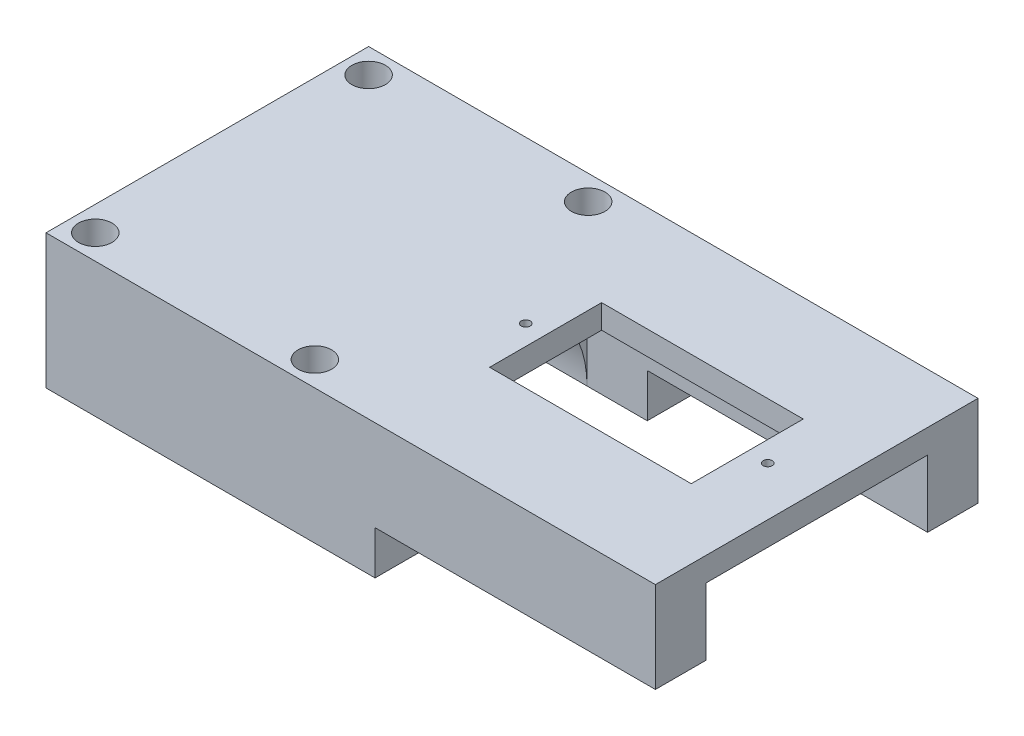
ISO-10303-21;
HEADER;
FILE_DESCRIPTION(('STEP AP214'),'2;1');
FILE_NAME('part.step','',(''),(''),'','','');
FILE_SCHEMA(('AUTOMOTIVE_DESIGN { 1 0 10303 214 1 1 1 1 }'));
ENDSEC;
DATA;
#1=APPLICATION_CONTEXT('core data for automotive mechanical design processes');
#2=APPLICATION_PROTOCOL_DEFINITION('international standard','automotive_design',2000,#1);
#3=PRODUCT_CONTEXT('',#1,'mechanical');
#4=PRODUCT('Part','Part','',(#3));
#5=PRODUCT_RELATED_PRODUCT_CATEGORY('part','',(#4));
#6=PRODUCT_DEFINITION_FORMATION('','',#4);
#7=PRODUCT_DEFINITION_CONTEXT('part definition',#1,'design');
#8=PRODUCT_DEFINITION('design','',#6,#7);
#9=PRODUCT_DEFINITION_SHAPE('','',#8);
#10=(LENGTH_UNIT() NAMED_UNIT(*) SI_UNIT(.MILLI.,.METRE.));
#11=(NAMED_UNIT(*) PLANE_ANGLE_UNIT() SI_UNIT($,.RADIAN.));
#12=(NAMED_UNIT(*) SI_UNIT($,.STERADIAN.) SOLID_ANGLE_UNIT());
#13=UNCERTAINTY_MEASURE_WITH_UNIT(LENGTH_MEASURE(1.E-05),#10,'distance_accuracy_value','');
#14=(GEOMETRIC_REPRESENTATION_CONTEXT(3) GLOBAL_UNCERTAINTY_ASSIGNED_CONTEXT((#13)) GLOBAL_UNIT_ASSIGNED_CONTEXT((#10,
#11,#12)) REPRESENTATION_CONTEXT('',''));
#15=CARTESIAN_POINT('',(0.,0.,0.));
#16=DIRECTION('',(0.,0.,1.));
#17=DIRECTION('',(1.,0.,0.));
#18=AXIS2_PLACEMENT_3D('',#15,#16,#17);
#19=CARTESIAN_POINT('',(15.,30.,18.));
#20=DIRECTION('',(-1.,0.,0.));
#21=DIRECTION('',(0.,0.,1.));
#22=AXIS2_PLACEMENT_3D('',#19,#20,#21);
#23=PLANE('',#22);
#24=DIRECTION('',(0.,-1.,0.));
#25=VECTOR('',#24,1.);
#26=CARTESIAN_POINT('',(15.,27.3313976045781,-12.375));
#27=LINE('',#26,#25);
#28=CARTESIAN_POINT('',(15.,27.3313976045781,-12.375));
#29=VERTEX_POINT('',#28);
#30=CARTESIAN_POINT('',(15.,15.,-12.375));
#31=VERTEX_POINT('',#30);
#32=EDGE_CURVE('E341',#29,#31,#27,.T.);
#33=ORIENTED_EDGE('',*,*,#32,.F.);
#34=DIRECTION('',(0.,0.,-1.));
#35=VECTOR('',#34,1.);
#36=CARTESIAN_POINT('',(15.,27.3313976045781,12.375));
#37=LINE('',#36,#35);
#38=CARTESIAN_POINT('',(15.,27.3313976045781,-1.03791045750838));
#39=VERTEX_POINT('',#38);
#40=EDGE_CURVE('E271',#39,#29,#37,.T.);
#41=ORIENTED_EDGE('',*,*,#40,.F.);
#42=CARTESIAN_POINT('',(15.,15.,0.));
#43=DIRECTION('',(1.,0.,0.));
#44=DIRECTION('',(0.,0.,-1.));
#45=AXIS2_PLACEMENT_3D('',#42,#43,#44);
#46=CIRCLE('',#45,12.375);
#47=EDGE_CURVE('E249',#31,#39,#46,.T.);
#48=ORIENTED_EDGE('',*,*,#47,.F.);
#49=EDGE_LOOP('',(#33,#41,#48));
#50=FACE_BOUND('',#49,.T.);
#51=ADVANCED_FACE('F49',(#50),#23,.F.);
#52=CARTESIAN_POINT('',(15.,27.3313976045781,12.375));
#53=VERTEX_POINT('',#52);
#54=CARTESIAN_POINT('',(15.,27.3313976045781,1.03791045750838));
#55=VERTEX_POINT('',#54);
#56=EDGE_CURVE('E337',#53,#55,#37,.T.);
#57=ORIENTED_EDGE('',*,*,#56,.F.);
#58=DIRECTION('',(0.,1.,0.));
#59=VECTOR('',#58,1.);
#60=CARTESIAN_POINT('',(15.,15.,12.375));
#61=LINE('',#60,#59);
#62=CARTESIAN_POINT('',(15.,15.,12.375));
#63=VERTEX_POINT('',#62);
#64=EDGE_CURVE('E299',#63,#53,#61,.T.);
#65=ORIENTED_EDGE('',*,*,#64,.F.);
#66=EDGE_CURVE('E248',#55,#63,#46,.T.);
#67=ORIENTED_EDGE('',*,*,#66,.F.);
#68=EDGE_LOOP('',(#57,#65,#67));
#69=FACE_BOUND('',#68,.T.);
#70=ADVANCED_FACE('F463',(#69),#23,.F.);
#71=CARTESIAN_POINT('',(-15.,30.,-18.));
#72=DIRECTION('',(0.,0.,1.));
#73=DIRECTION('',(1.,0.,0.));
#74=AXIS2_PLACEMENT_3D('',#71,#72,#73);
#75=PLANE('',#74);
#76=DIRECTION('',(0.,1.,0.));
#77=VECTOR('',#76,1.);
#78=CARTESIAN_POINT('',(53.,27.3313976045781,-18.));
#79=LINE('',#78,#77);
#80=CARTESIAN_POINT('',(53.,19.8616723081027,-18.));
#81=VERTEX_POINT('',#80);
#82=CARTESIAN_POINT('',(53.,30.,-18.));
#83=VERTEX_POINT('',#82);
#84=EDGE_CURVE('E319',#81,#83,#79,.T.);
#85=ORIENTED_EDGE('',*,*,#84,.F.);
#86=DIRECTION('',(1.,0.,0.));
#87=VECTOR('',#86,1.);
#88=CARTESIAN_POINT('',(53.,19.8616723081027,-18.));
#89=LINE('',#88,#87);
#90=CARTESIAN_POINT('',(21.7187331461162,19.8616723081027,-18.));
#91=VERTEX_POINT('',#90);
#92=EDGE_CURVE('E64',#91,#81,#89,.T.);
#93=ORIENTED_EDGE('',*,*,#92,.F.);
#94=DIRECTION('',(0.,1.,0.));
#95=VECTOR('',#94,1.);
#96=CARTESIAN_POINT('',(21.7187331461162,15.,-18.));
#97=LINE('',#96,#95);
#98=CARTESIAN_POINT('',(21.7187331461162,15.,-18.));
#99=VERTEX_POINT('',#98);
#100=EDGE_CURVE('E179',#99,#91,#97,.T.);
#101=ORIENTED_EDGE('',*,*,#100,.F.);
#102=DIRECTION('',(1.,0.,0.));
#103=VECTOR('',#102,1.);
#104=CARTESIAN_POINT('',(-15.,15.,-18.));
#105=LINE('',#104,#103);
#106=CARTESIAN_POINT('',(-15.,15.,-18.));
#107=VERTEX_POINT('',#106);
#108=EDGE_CURVE('E192',#107,#99,#105,.T.);
#109=ORIENTED_EDGE('',*,*,#108,.F.);
#110=DIRECTION('',(0.,-1.,0.));
#111=VECTOR('',#110,1.);
#112=CARTESIAN_POINT('',(-15.,30.,-18.));
#113=LINE('',#112,#111);
#114=CARTESIAN_POINT('',(-15.,30.,-18.));
#115=VERTEX_POINT('',#114);
#116=EDGE_CURVE('E268',#115,#107,#113,.T.);
#117=ORIENTED_EDGE('',*,*,#116,.F.);
#118=DIRECTION('',(-1.,0.,0.));
#119=VECTOR('',#118,1.);
#120=CARTESIAN_POINT('',(-15.,30.,-18.));
#121=LINE('',#120,#119);
#122=EDGE_CURVE('E255',#83,#115,#121,.T.);
#123=ORIENTED_EDGE('',*,*,#122,.F.);
#124=EDGE_LOOP('',(#85,#93,#101,#109,#117,#123));
#125=FACE_BOUND('',#124,.T.);
#126=ADVANCED_FACE('F190',(#125),#75,.F.);
#127=CARTESIAN_POINT('',(-15.,30.,18.));
#128=DIRECTION('',(1.,0.,0.));
#129=DIRECTION('',(0.,0.,-1.));
#130=AXIS2_PLACEMENT_3D('',#127,#128,#129);
#131=PLANE('',#130);
#132=ORIENTED_EDGE('',*,*,#116,.T.);
#133=DIRECTION('',(0.,0.,1.));
#134=VECTOR('',#133,1.);
#135=CARTESIAN_POINT('',(-15.,15.,18.));
#136=LINE('',#135,#134);
#137=CARTESIAN_POINT('',(-15.,15.,-12.375));
#138=VERTEX_POINT('',#137);
#139=EDGE_CURVE('E198',#107,#138,#136,.T.);
#140=ORIENTED_EDGE('',*,*,#139,.T.);
#141=CARTESIAN_POINT('',(-15.,15.,0.));
#142=DIRECTION('',(1.,0.,0.));
#143=DIRECTION('',(0.,0.,-1.));
#144=AXIS2_PLACEMENT_3D('',#141,#142,#143);
#145=CIRCLE('',#144,12.375);
#146=CARTESIAN_POINT('',(-15.,15.,12.375));
#147=VERTEX_POINT('',#146);
#148=EDGE_CURVE('E253',#138,#147,#145,.T.);
#149=ORIENTED_EDGE('',*,*,#148,.T.);
#150=CARTESIAN_POINT('',(-15.,15.,18.));
#151=VERTEX_POINT('',#150);
#152=EDGE_CURVE('E356',#147,#151,#136,.T.);
#153=ORIENTED_EDGE('',*,*,#152,.T.);
#154=DIRECTION('',(0.,-1.,0.));
#155=VECTOR('',#154,1.);
#156=CARTESIAN_POINT('',(-15.,30.,18.));
#157=LINE('',#156,#155);
#158=CARTESIAN_POINT('',(-15.,30.,18.));
#159=VERTEX_POINT('',#158);
#160=EDGE_CURVE('E264',#159,#151,#157,.T.);
#161=ORIENTED_EDGE('',*,*,#160,.F.);
#162=DIRECTION('',(0.,0.,1.));
#163=VECTOR('',#162,1.);
#164=CARTESIAN_POINT('',(-15.,30.,18.));
#165=LINE('',#164,#163);
#166=EDGE_CURVE('E258',#115,#159,#165,.T.);
#167=ORIENTED_EDGE('',*,*,#166,.F.);
#168=EDGE_LOOP('',(#132,#140,#149,#153,#161,#167));
#169=FACE_BOUND('',#168,.T.);
#170=ADVANCED_FACE('F367',(#169),#131,.F.);
#171=CARTESIAN_POINT('',(-15.,30.,18.));
#172=DIRECTION('',(0.,0.,-1.));
#173=DIRECTION('',(-1.,0.,0.));
#174=AXIS2_PLACEMENT_3D('',#171,#172,#173);
#175=PLANE('',#174);
#176=DIRECTION('',(0.,1.,0.));
#177=VECTOR('',#176,1.);
#178=CARTESIAN_POINT('',(21.7187331461162,15.,18.));
#179=LINE('',#178,#177);
#180=CARTESIAN_POINT('',(21.7187331461162,15.,18.));
#181=VERTEX_POINT('',#180);
#182=CARTESIAN_POINT('',(21.7187331461162,19.8616723081027,18.));
#183=VERTEX_POINT('',#182);
#184=EDGE_CURVE('E382',#181,#183,#179,.T.);
#185=ORIENTED_EDGE('',*,*,#184,.T.);
#186=DIRECTION('',(1.,0.,0.));
#187=VECTOR('',#186,1.);
#188=CARTESIAN_POINT('',(53.,19.8616723081027,18.));
#189=LINE('',#188,#187);
#190=CARTESIAN_POINT('',(53.,19.8616723081027,18.));
#191=VERTEX_POINT('',#190);
#192=EDGE_CURVE('E185',#183,#191,#189,.T.);
#193=ORIENTED_EDGE('',*,*,#192,.T.);
#194=DIRECTION('',(0.,-1.,0.));
#195=VECTOR('',#194,1.);
#196=CARTESIAN_POINT('',(53.,30.,18.));
#197=LINE('',#196,#195);
#198=CARTESIAN_POINT('',(53.,30.,18.));
#199=VERTEX_POINT('',#198);
#200=EDGE_CURVE('E345',#199,#191,#197,.T.);
#201=ORIENTED_EDGE('',*,*,#200,.F.);
#202=DIRECTION('',(1.,0.,0.));
#203=VECTOR('',#202,1.);
#204=CARTESIAN_POINT('',(-15.,30.,18.));
#205=LINE('',#204,#203);
#206=EDGE_CURVE('E261',#159,#199,#205,.T.);
#207=ORIENTED_EDGE('',*,*,#206,.F.);
#208=ORIENTED_EDGE('',*,*,#160,.T.);
#209=DIRECTION('',(1.,0.,0.));
#210=VECTOR('',#209,1.);
#211=CARTESIAN_POINT('',(-15.,15.,18.));
#212=LINE('',#211,#210);
#213=EDGE_CURVE('E201',#151,#181,#212,.T.);
#214=ORIENTED_EDGE('',*,*,#213,.T.);
#215=EDGE_LOOP('',(#185,#193,#201,#207,#208,#214));
#216=FACE_BOUND('',#215,.T.);
#217=ADVANCED_FACE('F380',(#216),#175,.F.);
#218=CARTESIAN_POINT('',(0.,30.,0.));
#219=DIRECTION('',(0.,-1.,0.));
#220=DIRECTION('',(0.,0.,-1.));
#221=AXIS2_PLACEMENT_3D('',#218,#219,#220);
#222=PLANE('',#221);
#223=CARTESIAN_POINT('',(20.5328469135084,30.,0.));
#224=DIRECTION('',(0.,1.,0.));
#225=DIRECTION('',(0.,0.,1.));
#226=AXIS2_PLACEMENT_3D('',#223,#224,#225);
#227=CIRCLE('',#226,0.499999999999999);
#228=CARTESIAN_POINT('',(20.5328469135084,30.,0.499999999999999));
#229=VERTEX_POINT('',#228);
#230=EDGE_CURVE('E423',#229,#229,#227,.T.);
#231=ORIENTED_EDGE('',*,*,#230,.F.);
#232=EDGE_LOOP('',(#231));
#233=FACE_BOUND('',#232,.T.);
#234=CARTESIAN_POINT('',(47.5328469135084,30.,0.));
#235=DIRECTION('',(0.,1.,0.));
#236=DIRECTION('',(0.,0.,-1.));
#237=AXIS2_PLACEMENT_3D('',#234,#235,#236);
#238=CIRCLE('',#237,0.499999999999999);
#239=CARTESIAN_POINT('',(47.5328469135084,30.,-0.499999999999999));
#240=VERTEX_POINT('',#239);
#241=EDGE_CURVE('E422',#240,#240,#238,.T.);
#242=ORIENTED_EDGE('',*,*,#241,.F.);
#243=EDGE_LOOP('',(#242));
#244=FACE_BOUND('',#243,.T.);
#245=DIRECTION('',(-1.,0.,0.));
#246=VECTOR('',#245,1.);
#247=CARTESIAN_POINT('',(22.75,30.,-6.25));
#248=LINE('',#247,#246);
#249=CARTESIAN_POINT('',(45.25,30.,-6.25));
#250=VERTEX_POINT('',#249);
#251=CARTESIAN_POINT('',(22.75,30.,-6.25));
#252=VERTEX_POINT('',#251);
#253=EDGE_CURVE('E415',#250,#252,#248,.T.);
#254=ORIENTED_EDGE('',*,*,#253,.F.);
#255=DIRECTION('',(0.,0.,-1.));
#256=VECTOR('',#255,1.);
#257=CARTESIAN_POINT('',(45.25,30.,6.25));
#258=LINE('',#257,#256);
#259=CARTESIAN_POINT('',(45.25,30.,6.25));
#260=VERTEX_POINT('',#259);
#261=EDGE_CURVE('E419',#260,#250,#258,.T.);
#262=ORIENTED_EDGE('',*,*,#261,.F.);
#263=DIRECTION('',(1.,0.,0.));
#264=VECTOR('',#263,1.);
#265=CARTESIAN_POINT('',(22.75,30.,6.25));
#266=LINE('',#265,#264);
#267=CARTESIAN_POINT('',(22.75,30.,6.25));
#268=VERTEX_POINT('',#267);
#269=EDGE_CURVE('E400',#268,#260,#266,.T.);
#270=ORIENTED_EDGE('',*,*,#269,.F.);
#271=DIRECTION('',(0.,0.,1.));
#272=VECTOR('',#271,1.);
#273=CARTESIAN_POINT('',(22.75,30.,6.25));
#274=LINE('',#273,#272);
#275=EDGE_CURVE('E411',#252,#268,#274,.T.);
#276=ORIENTED_EDGE('',*,*,#275,.F.);
#277=EDGE_LOOP('',(#254,#262,#270,#276));
#278=FACE_BOUND('',#277,.T.);
#279=CARTESIAN_POINT('',(12.25,30.,-15.25));
#280=DIRECTION('',(0.,1.,0.));
#281=DIRECTION('',(0.,0.,-1.));
#282=AXIS2_PLACEMENT_3D('',#279,#280,#281);
#283=CIRCLE('',#282,1.875);
#284=CARTESIAN_POINT('',(12.25,30.,-17.125));
#285=VERTEX_POINT('',#284);
#286=EDGE_CURVE('E232',#285,#285,#283,.T.);
#287=ORIENTED_EDGE('',*,*,#286,.F.);
#288=EDGE_LOOP('',(#287));
#289=FACE_BOUND('',#288,.T.);
#290=CARTESIAN_POINT('',(12.25,30.,15.25));
#291=DIRECTION('',(0.,1.,0.));
#292=DIRECTION('',(0.,0.,1.));
#293=AXIS2_PLACEMENT_3D('',#290,#291,#292);
#294=CIRCLE('',#293,1.875);
#295=CARTESIAN_POINT('',(12.25,30.,17.125));
#296=VERTEX_POINT('',#295);
#297=EDGE_CURVE('E238',#296,#296,#294,.T.);
#298=ORIENTED_EDGE('',*,*,#297,.F.);
#299=EDGE_LOOP('',(#298));
#300=FACE_BOUND('',#299,.T.);
#301=CARTESIAN_POINT('',(-12.25,30.,15.25));
#302=DIRECTION('',(0.,1.,0.));
#303=DIRECTION('',(0.,0.,-1.));
#304=AXIS2_PLACEMENT_3D('',#301,#302,#303);
#305=CIRCLE('',#304,1.875);
#306=CARTESIAN_POINT('',(-12.25,30.,13.375));
#307=VERTEX_POINT('',#306);
#308=EDGE_CURVE('E233',#307,#307,#305,.T.);
#309=ORIENTED_EDGE('',*,*,#308,.F.);
#310=EDGE_LOOP('',(#309));
#311=FACE_BOUND('',#310,.T.);
#312=CARTESIAN_POINT('',(-12.25,30.,-15.25));
#313=DIRECTION('',(0.,1.,0.));
#314=DIRECTION('',(0.,0.,1.));
#315=AXIS2_PLACEMENT_3D('',#312,#313,#314);
#316=CIRCLE('',#315,1.875);
#317=CARTESIAN_POINT('',(-12.25,30.,-13.375));
#318=VERTEX_POINT('',#317);
#319=EDGE_CURVE('E237',#318,#318,#316,.T.);
#320=ORIENTED_EDGE('',*,*,#319,.F.);
#321=EDGE_LOOP('',(#320));
#322=FACE_BOUND('',#321,.T.);
#323=ORIENTED_EDGE('',*,*,#206,.T.);
#324=DIRECTION('',(0.,0.,1.));
#325=VECTOR('',#324,1.);
#326=CARTESIAN_POINT('',(53.,30.,18.));
#327=LINE('',#326,#325);
#328=EDGE_CURVE('E323',#83,#199,#327,.T.);
#329=ORIENTED_EDGE('',*,*,#328,.F.);
#330=ORIENTED_EDGE('',*,*,#122,.T.);
#331=ORIENTED_EDGE('',*,*,#166,.T.);
#332=EDGE_LOOP('',(#323,#329,#330,#331));
#333=FACE_BOUND('',#332,.T.);
#334=ADVANCED_FACE('F386',(#233,#244,#278,#289,#300,#311,#322,#333),#222,.F.);
#335=CARTESIAN_POINT('',(-25.,15.,0.));
#336=DIRECTION('',(1.,0.,0.));
#337=DIRECTION('',(0.,0.,-1.));
#338=AXIS2_PLACEMENT_3D('',#335,#336,#337);
#339=CYLINDRICAL_SURFACE('',#338,12.375);
#340=ORIENTED_EDGE('',*,*,#47,.T.);
#341=EDGE_CURVE('E254',#39,#55,#46,.T.);
#342=ORIENTED_EDGE('',*,*,#341,.T.);
#343=ORIENTED_EDGE('',*,*,#66,.T.);
#344=DIRECTION('',(1.,0.,0.));
#345=VECTOR('',#344,1.);
#346=CARTESIAN_POINT('',(-25.,15.,12.375));
#347=LINE('',#346,#345);
#348=EDGE_CURVE('E228',#63,#147,#347,.F.);
#349=ORIENTED_EDGE('',*,*,#348,.T.);
#350=ORIENTED_EDGE('',*,*,#148,.F.);
#351=DIRECTION('',(1.,0.,0.));
#352=VECTOR('',#351,1.);
#353=CARTESIAN_POINT('',(-25.,15.,-12.375));
#354=LINE('',#353,#352);
#355=EDGE_CURVE('E224',#138,#31,#354,.T.);
#356=ORIENTED_EDGE('',*,*,#355,.T.);
#357=EDGE_LOOP('',(#340,#342,#343,#349,#350,#356));
#358=FACE_BOUND('',#357,.T.);
#359=ADVANCED_FACE('F370',(#358),#339,.F.);
#360=CARTESIAN_POINT('',(-12.25,-10.,-15.25));
#361=DIRECTION('',(0.,1.,0.));
#362=DIRECTION('',(0.,0.,1.));
#363=AXIS2_PLACEMENT_3D('',#360,#361,#362);
#364=CYLINDRICAL_SURFACE('',#363,1.875);
#365=CARTESIAN_POINT('',(-12.25,15.,-15.25));
#366=DIRECTION('',(0.,1.,0.));
#367=DIRECTION('',(0.,0.,1.));
#368=AXIS2_PLACEMENT_3D('',#365,#366,#367);
#369=CIRCLE('',#368,1.875);
#370=CARTESIAN_POINT('',(-12.25,15.,-13.375));
#371=VERTEX_POINT('',#370);
#372=EDGE_CURVE('E220',#371,#371,#369,.F.);
#373=ORIENTED_EDGE('',*,*,#372,.T.);
#374=EDGE_LOOP('',(#373));
#375=FACE_BOUND('',#374,.T.);
#376=ORIENTED_EDGE('',*,*,#319,.T.);
#377=EDGE_LOOP('',(#376));
#378=FACE_BOUND('',#377,.T.);
#379=ADVANCED_FACE('F497',(#375,#378),#364,.F.);
#380=CARTESIAN_POINT('',(-12.25,-10.,15.25));
#381=DIRECTION('',(0.,1.,0.));
#382=DIRECTION('',(0.,0.,1.));
#383=AXIS2_PLACEMENT_3D('',#380,#381,#382);
#384=CYLINDRICAL_SURFACE('',#383,1.875);
#385=CARTESIAN_POINT('',(-12.25,15.,15.25));
#386=DIRECTION('',(0.,1.,0.));
#387=DIRECTION('',(0.,0.,1.));
#388=AXIS2_PLACEMENT_3D('',#385,#386,#387);
#389=CIRCLE('',#388,1.875);
#390=CARTESIAN_POINT('',(-12.25,15.,17.125));
#391=VERTEX_POINT('',#390);
#392=EDGE_CURVE('E216',#391,#391,#389,.F.);
#393=ORIENTED_EDGE('',*,*,#392,.T.);
#394=EDGE_LOOP('',(#393));
#395=FACE_BOUND('',#394,.T.);
#396=ORIENTED_EDGE('',*,*,#308,.T.);
#397=EDGE_LOOP('',(#396));
#398=FACE_BOUND('',#397,.T.);
#399=ADVANCED_FACE('F500',(#395,#398),#384,.F.);
#400=CARTESIAN_POINT('',(12.25,-10.,15.25));
#401=DIRECTION('',(0.,1.,0.));
#402=DIRECTION('',(0.,0.,1.));
#403=AXIS2_PLACEMENT_3D('',#400,#401,#402);
#404=CYLINDRICAL_SURFACE('',#403,1.875);
#405=CARTESIAN_POINT('',(12.25,15.,15.25));
#406=DIRECTION('',(0.,1.,0.));
#407=DIRECTION('',(0.,0.,1.));
#408=AXIS2_PLACEMENT_3D('',#405,#406,#407);
#409=CIRCLE('',#408,1.875);
#410=CARTESIAN_POINT('',(12.25,15.,17.125));
#411=VERTEX_POINT('',#410);
#412=EDGE_CURVE('E206',#411,#411,#409,.F.);
#413=ORIENTED_EDGE('',*,*,#412,.T.);
#414=EDGE_LOOP('',(#413));
#415=FACE_BOUND('',#414,.T.);
#416=ORIENTED_EDGE('',*,*,#297,.T.);
#417=EDGE_LOOP('',(#416));
#418=FACE_BOUND('',#417,.T.);
#419=ADVANCED_FACE('F505',(#415,#418),#404,.F.);
#420=CARTESIAN_POINT('',(12.25,-10.,-15.25));
#421=DIRECTION('',(0.,1.,0.));
#422=DIRECTION('',(0.,0.,1.));
#423=AXIS2_PLACEMENT_3D('',#420,#421,#422);
#424=CYLINDRICAL_SURFACE('',#423,1.875);
#425=CARTESIAN_POINT('',(12.25,15.,-15.25));
#426=DIRECTION('',(0.,1.,0.));
#427=DIRECTION('',(0.,0.,1.));
#428=AXIS2_PLACEMENT_3D('',#425,#426,#427);
#429=CIRCLE('',#428,1.875);
#430=CARTESIAN_POINT('',(12.25,15.,-13.375));
#431=VERTEX_POINT('',#430);
#432=EDGE_CURVE('E200',#431,#431,#429,.F.);
#433=ORIENTED_EDGE('',*,*,#432,.T.);
#434=EDGE_LOOP('',(#433));
#435=FACE_BOUND('',#434,.T.);
#436=ORIENTED_EDGE('',*,*,#286,.T.);
#437=EDGE_LOOP('',(#436));
#438=FACE_BOUND('',#437,.T.);
#439=ADVANCED_FACE('F502',(#435,#438),#424,.F.);
#440=CARTESIAN_POINT('',(-15.,15.,18.));
#441=DIRECTION('',(0.,1.,0.));
#442=DIRECTION('',(0.,0.,1.));
#443=AXIS2_PLACEMENT_3D('',#440,#441,#442);
#444=PLANE('',#443);
#445=ORIENTED_EDGE('',*,*,#372,.F.);
#446=EDGE_LOOP('',(#445));
#447=FACE_BOUND('',#446,.T.);
#448=ORIENTED_EDGE('',*,*,#432,.F.);
#449=EDGE_LOOP('',(#448));
#450=FACE_BOUND('',#449,.T.);
#451=ORIENTED_EDGE('',*,*,#108,.T.);
#452=DIRECTION('',(0.,0.,-1.));
#453=VECTOR('',#452,1.);
#454=CARTESIAN_POINT('',(21.7187331461162,15.,18.));
#455=LINE('',#454,#453);
#456=CARTESIAN_POINT('',(21.7187331461162,15.,-12.375));
#457=VERTEX_POINT('',#456);
#458=EDGE_CURVE('E175',#457,#99,#455,.T.);
#459=ORIENTED_EDGE('',*,*,#458,.F.);
#460=DIRECTION('',(-1.,0.,0.));
#461=VECTOR('',#460,1.);
#462=CARTESIAN_POINT('',(53.,15.,-12.375));
#463=LINE('',#462,#461);
#464=EDGE_CURVE('E332',#457,#31,#463,.T.);
#465=ORIENTED_EDGE('',*,*,#464,.T.);
#466=ORIENTED_EDGE('',*,*,#355,.F.);
#467=ORIENTED_EDGE('',*,*,#139,.F.);
#468=EDGE_LOOP('',(#451,#459,#465,#466,#467));
#469=FACE_BOUND('',#468,.T.);
#470=ADVANCED_FACE('F196',(#447,#450,#469),#444,.F.);
#471=ORIENTED_EDGE('',*,*,#392,.F.);
#472=EDGE_LOOP('',(#471));
#473=FACE_BOUND('',#472,.T.);
#474=ORIENTED_EDGE('',*,*,#412,.F.);
#475=EDGE_LOOP('',(#474));
#476=FACE_BOUND('',#475,.T.);
#477=DIRECTION('',(-1.,0.,0.));
#478=VECTOR('',#477,1.);
#479=CARTESIAN_POINT('',(53.,15.,12.375));
#480=LINE('',#479,#478);
#481=CARTESIAN_POINT('',(21.7187331461162,15.,12.375));
#482=VERTEX_POINT('',#481);
#483=EDGE_CURVE('E354',#482,#63,#480,.T.);
#484=ORIENTED_EDGE('',*,*,#483,.F.);
#485=EDGE_CURVE('E184',#181,#482,#455,.T.);
#486=ORIENTED_EDGE('',*,*,#485,.F.);
#487=ORIENTED_EDGE('',*,*,#213,.F.);
#488=ORIENTED_EDGE('',*,*,#152,.F.);
#489=ORIENTED_EDGE('',*,*,#348,.F.);
#490=EDGE_LOOP('',(#484,#486,#487,#488,#489));
#491=FACE_BOUND('',#490,.T.);
#492=ADVANCED_FACE('F376',(#473,#476,#491),#444,.F.);
#493=CARTESIAN_POINT('',(53.,15.,12.375));
#494=DIRECTION('',(0.,0.,1.));
#495=DIRECTION('',(1.,0.,0.));
#496=AXIS2_PLACEMENT_3D('',#493,#494,#495);
#497=PLANE('',#496);
#498=DIRECTION('',(0.,1.,0.));
#499=VECTOR('',#498,1.);
#500=CARTESIAN_POINT('',(53.,15.,12.375));
#501=LINE('',#500,#499);
#502=CARTESIAN_POINT('',(53.,19.8616723081027,12.375));
#503=VERTEX_POINT('',#502);
#504=CARTESIAN_POINT('',(53.,27.3313976045781,12.375));
#505=VERTEX_POINT('',#504);
#506=EDGE_CURVE('E325',#503,#505,#501,.T.);
#507=ORIENTED_EDGE('',*,*,#506,.F.);
#508=DIRECTION('',(-1.,0.,0.));
#509=VECTOR('',#508,1.);
#510=CARTESIAN_POINT('',(53.,19.8616723081027,12.375));
#511=LINE('',#510,#509);
#512=CARTESIAN_POINT('',(21.7187331461162,19.8616723081027,12.375));
#513=VERTEX_POINT('',#512);
#514=EDGE_CURVE('E72',#503,#513,#511,.T.);
#515=ORIENTED_EDGE('',*,*,#514,.T.);
#516=DIRECTION('',(0.,-1.,0.));
#517=VECTOR('',#516,1.);
#518=CARTESIAN_POINT('',(21.7187331461162,15.,12.375));
#519=LINE('',#518,#517);
#520=EDGE_CURVE('E427',#513,#482,#519,.T.);
#521=ORIENTED_EDGE('',*,*,#520,.T.);
#522=ORIENTED_EDGE('',*,*,#483,.T.);
#523=ORIENTED_EDGE('',*,*,#64,.T.);
#524=DIRECTION('',(-1.,0.,0.));
#525=VECTOR('',#524,1.);
#526=CARTESIAN_POINT('',(53.,27.3313976045781,12.375));
#527=LINE('',#526,#525);
#528=EDGE_CURVE('E351',#505,#53,#527,.T.);
#529=ORIENTED_EDGE('',*,*,#528,.F.);
#530=EDGE_LOOP('',(#507,#515,#521,#522,#523,#529));
#531=FACE_BOUND('',#530,.T.);
#532=ADVANCED_FACE('F465',(#531),#497,.F.);
#533=CARTESIAN_POINT('',(53.,27.3313976045781,12.375));
#534=DIRECTION('',(0.,1.,0.));
#535=DIRECTION('',(0.,0.,1.));
#536=AXIS2_PLACEMENT_3D('',#533,#534,#535);
#537=PLANE('',#536);
#538=CARTESIAN_POINT('',(20.5328469135084,27.3313976045781,0.));
#539=DIRECTION('',(0.,1.,0.));
#540=DIRECTION('',(0.,0.,1.));
#541=AXIS2_PLACEMENT_3D('',#538,#539,#540);
#542=CIRCLE('',#541,0.499999999999999);
#543=CARTESIAN_POINT('',(20.5328469135084,27.3313976045781,0.499999999999999));
#544=VERTEX_POINT('',#543);
#545=EDGE_CURVE('E295',#544,#544,#542,.T.);
#546=ORIENTED_EDGE('',*,*,#545,.T.);
#547=EDGE_LOOP('',(#546));
#548=FACE_BOUND('',#547,.T.);
#549=CARTESIAN_POINT('',(47.5328469135084,27.3313976045781,0.));
#550=DIRECTION('',(0.,1.,0.));
#551=DIRECTION('',(0.,0.,1.));
#552=AXIS2_PLACEMENT_3D('',#549,#550,#551);
#553=CIRCLE('',#552,0.499999999999999);
#554=CARTESIAN_POINT('',(47.5328469135084,27.3313976045781,0.499999999999999));
#555=VERTEX_POINT('',#554);
#556=EDGE_CURVE('E291',#555,#555,#553,.T.);
#557=ORIENTED_EDGE('',*,*,#556,.T.);
#558=EDGE_LOOP('',(#557));
#559=FACE_BOUND('',#558,.T.);
#560=DIRECTION('',(1.,0.,0.));
#561=VECTOR('',#560,1.);
#562=CARTESIAN_POINT('',(53.,27.3313976045781,6.25));
#563=LINE('',#562,#561);
#564=CARTESIAN_POINT('',(22.75,27.3313976045781,6.25));
#565=VERTEX_POINT('',#564);
#566=CARTESIAN_POINT('',(45.25,27.3313976045781,6.25));
#567=VERTEX_POINT('',#566);
#568=EDGE_CURVE('E283',#565,#567,#563,.T.);
#569=ORIENTED_EDGE('',*,*,#568,.T.);
#570=DIRECTION('',(0.,0.,-1.));
#571=VECTOR('',#570,1.);
#572=CARTESIAN_POINT('',(45.25,27.3313976045781,12.375));
#573=LINE('',#572,#571);
#574=CARTESIAN_POINT('',(45.25,27.3313976045781,-6.25));
#575=VERTEX_POINT('',#574);
#576=EDGE_CURVE('E287',#567,#575,#573,.T.);
#577=ORIENTED_EDGE('',*,*,#576,.T.);
#578=DIRECTION('',(-1.,0.,0.));
#579=VECTOR('',#578,1.);
#580=CARTESIAN_POINT('',(53.,27.3313976045781,-6.25));
#581=LINE('',#580,#579);
#582=CARTESIAN_POINT('',(22.75,27.3313976045781,-6.25));
#583=VERTEX_POINT('',#582);
#584=EDGE_CURVE('E275',#575,#583,#581,.T.);
#585=ORIENTED_EDGE('',*,*,#584,.T.);
#586=DIRECTION('',(0.,0.,1.));
#587=VECTOR('',#586,1.);
#588=CARTESIAN_POINT('',(22.75,27.3313976045781,12.375));
#589=LINE('',#588,#587);
#590=EDGE_CURVE('E279',#583,#565,#589,.T.);
#591=ORIENTED_EDGE('',*,*,#590,.T.);
#592=EDGE_LOOP('',(#569,#577,#585,#591));
#593=FACE_BOUND('',#592,.T.);
#594=ORIENTED_EDGE('',*,*,#56,.T.);
#595=EDGE_CURVE('E336',#55,#39,#37,.T.);
#596=ORIENTED_EDGE('',*,*,#595,.T.);
#597=ORIENTED_EDGE('',*,*,#40,.T.);
#598=DIRECTION('',(-1.,0.,0.));
#599=VECTOR('',#598,1.);
#600=CARTESIAN_POINT('',(53.,27.3313976045781,-12.375));
#601=LINE('',#600,#599);
#602=CARTESIAN_POINT('',(53.,27.3313976045781,-12.375));
#603=VERTEX_POINT('',#602);
#604=EDGE_CURVE('E348',#603,#29,#601,.T.);
#605=ORIENTED_EDGE('',*,*,#604,.F.);
#606=DIRECTION('',(0.,0.,-1.));
#607=VECTOR('',#606,1.);
#608=CARTESIAN_POINT('',(53.,27.3313976045781,12.375));
#609=LINE('',#608,#607);
#610=EDGE_CURVE('E316',#505,#603,#609,.T.);
#611=ORIENTED_EDGE('',*,*,#610,.F.);
#612=ORIENTED_EDGE('',*,*,#528,.T.);
#613=EDGE_LOOP('',(#594,#596,#597,#605,#611,#612));
#614=FACE_BOUND('',#613,.T.);
#615=ADVANCED_FACE('F454',(#548,#559,#593,#614),#537,.F.);
#616=CARTESIAN_POINT('',(53.,27.3313976045781,-12.375));
#617=DIRECTION('',(0.,0.,-1.));
#618=DIRECTION('',(-1.,0.,0.));
#619=AXIS2_PLACEMENT_3D('',#616,#617,#618);
#620=PLANE('',#619);
#621=DIRECTION('',(0.,1.,0.));
#622=VECTOR('',#621,1.);
#623=CARTESIAN_POINT('',(21.7187331461162,27.3313976045781,-12.375));
#624=LINE('',#623,#622);
#625=CARTESIAN_POINT('',(21.7187331461162,19.8616723081027,-12.375));
#626=VERTEX_POINT('',#625);
#627=EDGE_CURVE('E11',#457,#626,#624,.T.);
#628=ORIENTED_EDGE('',*,*,#627,.T.);
#629=DIRECTION('',(1.,0.,0.));
#630=VECTOR('',#629,1.);
#631=CARTESIAN_POINT('',(53.,19.8616723081027,-12.375));
#632=LINE('',#631,#630);
#633=CARTESIAN_POINT('',(53.,19.8616723081027,-12.375));
#634=VERTEX_POINT('',#633);
#635=EDGE_CURVE('E303',#626,#634,#632,.T.);
#636=ORIENTED_EDGE('',*,*,#635,.T.);
#637=DIRECTION('',(0.,-1.,0.));
#638=VECTOR('',#637,1.);
#639=CARTESIAN_POINT('',(53.,27.3313976045781,-12.375));
#640=LINE('',#639,#638);
#641=EDGE_CURVE('E310',#603,#634,#640,.T.);
#642=ORIENTED_EDGE('',*,*,#641,.F.);
#643=ORIENTED_EDGE('',*,*,#604,.T.);
#644=ORIENTED_EDGE('',*,*,#32,.T.);
#645=ORIENTED_EDGE('',*,*,#464,.F.);
#646=EDGE_LOOP('',(#628,#636,#642,#643,#644,#645));
#647=FACE_BOUND('',#646,.T.);
#648=ADVANCED_FACE('F308',(#647),#620,.F.);
#649=CARTESIAN_POINT('',(53.,0.,0.));
#650=DIRECTION('',(1.,0.,0.));
#651=DIRECTION('',(0.,0.,-1.));
#652=AXIS2_PLACEMENT_3D('',#649,#650,#651);
#653=PLANE('',#652);
#654=DIRECTION('',(0.,0.,1.));
#655=VECTOR('',#654,1.);
#656=CARTESIAN_POINT('',(53.,19.8616723081027,0.));
#657=LINE('',#656,#655);
#658=EDGE_CURVE('E57',#81,#634,#657,.T.);
#659=ORIENTED_EDGE('',*,*,#658,.F.);
#660=ORIENTED_EDGE('',*,*,#84,.T.);
#661=ORIENTED_EDGE('',*,*,#328,.T.);
#662=ORIENTED_EDGE('',*,*,#200,.T.);
#663=DIRECTION('',(0.,0.,-1.));
#664=VECTOR('',#663,1.);
#665=CARTESIAN_POINT('',(53.,19.8616723081027,18.));
#666=LINE('',#665,#664);
#667=EDGE_CURVE('E312',#191,#503,#666,.T.);
#668=ORIENTED_EDGE('',*,*,#667,.T.);
#669=ORIENTED_EDGE('',*,*,#506,.T.);
#670=ORIENTED_EDGE('',*,*,#610,.T.);
#671=ORIENTED_EDGE('',*,*,#641,.T.);
#672=EDGE_LOOP('',(#659,#660,#661,#662,#668,#669,#670,#671));
#673=FACE_BOUND('',#672,.T.);
#674=ADVANCED_FACE('F314',(#673),#653,.T.);
#675=CARTESIAN_POINT('',(15.,0.,0.));
#676=DIRECTION('',(1.,0.,0.));
#677=DIRECTION('',(0.,0.,-1.));
#678=AXIS2_PLACEMENT_3D('',#675,#676,#677);
#679=PLANE('',#678);
#680=ORIENTED_EDGE('',*,*,#341,.F.);
#681=ORIENTED_EDGE('',*,*,#595,.F.);
#682=EDGE_LOOP('',(#680,#681));
#683=FACE_BOUND('',#682,.T.);
#684=ADVANCED_FACE('F458',(#683),#679,.F.);
#685=CARTESIAN_POINT('',(45.25,20.,6.25));
#686=DIRECTION('',(1.,0.,0.));
#687=DIRECTION('',(0.,0.,-1.));
#688=AXIS2_PLACEMENT_3D('',#685,#686,#687);
#689=PLANE('',#688);
#690=DIRECTION('',(0.,1.,0.));
#691=VECTOR('',#690,1.);
#692=CARTESIAN_POINT('',(45.25,20.,6.25));
#693=LINE('',#692,#691);
#694=EDGE_CURVE('E296',#567,#260,#693,.T.);
#695=ORIENTED_EDGE('',*,*,#694,.T.);
#696=ORIENTED_EDGE('',*,*,#261,.T.);
#697=DIRECTION('',(0.,1.,0.));
#698=VECTOR('',#697,1.);
#699=CARTESIAN_POINT('',(45.25,20.,-6.25));
#700=LINE('',#699,#698);
#701=EDGE_CURVE('E395',#575,#250,#700,.T.);
#702=ORIENTED_EDGE('',*,*,#701,.F.);
#703=ORIENTED_EDGE('',*,*,#576,.F.);
#704=EDGE_LOOP('',(#695,#696,#702,#703));
#705=FACE_BOUND('',#704,.T.);
#706=ADVANCED_FACE('F525',(#705),#689,.F.);
#707=CARTESIAN_POINT('',(22.75,20.,6.25));
#708=DIRECTION('',(0.,0.,1.));
#709=DIRECTION('',(1.,0.,0.));
#710=AXIS2_PLACEMENT_3D('',#707,#708,#709);
#711=PLANE('',#710);
#712=DIRECTION('',(0.,1.,0.));
#713=VECTOR('',#712,1.);
#714=CARTESIAN_POINT('',(22.75,20.,6.25));
#715=LINE('',#714,#713);
#716=EDGE_CURVE('E403',#565,#268,#715,.T.);
#717=ORIENTED_EDGE('',*,*,#716,.T.);
#718=ORIENTED_EDGE('',*,*,#269,.T.);
#719=ORIENTED_EDGE('',*,*,#694,.F.);
#720=ORIENTED_EDGE('',*,*,#568,.F.);
#721=EDGE_LOOP('',(#717,#718,#719,#720));
#722=FACE_BOUND('',#721,.T.);
#723=ADVANCED_FACE('F530',(#722),#711,.F.);
#724=CARTESIAN_POINT('',(22.75,20.,6.25));
#725=DIRECTION('',(-1.,0.,0.));
#726=DIRECTION('',(0.,0.,1.));
#727=AXIS2_PLACEMENT_3D('',#724,#725,#726);
#728=PLANE('',#727);
#729=DIRECTION('',(0.,1.,0.));
#730=VECTOR('',#729,1.);
#731=CARTESIAN_POINT('',(22.75,20.,-6.25));
#732=LINE('',#731,#730);
#733=EDGE_CURVE('E399',#583,#252,#732,.T.);
#734=ORIENTED_EDGE('',*,*,#733,.T.);
#735=ORIENTED_EDGE('',*,*,#275,.T.);
#736=ORIENTED_EDGE('',*,*,#716,.F.);
#737=ORIENTED_EDGE('',*,*,#590,.F.);
#738=EDGE_LOOP('',(#734,#735,#736,#737));
#739=FACE_BOUND('',#738,.T.);
#740=ADVANCED_FACE('F536',(#739),#728,.F.);
#741=CARTESIAN_POINT('',(22.75,20.,-6.25));
#742=DIRECTION('',(0.,0.,-1.));
#743=DIRECTION('',(-1.,0.,0.));
#744=AXIS2_PLACEMENT_3D('',#741,#742,#743);
#745=PLANE('',#744);
#746=ORIENTED_EDGE('',*,*,#701,.T.);
#747=ORIENTED_EDGE('',*,*,#253,.T.);
#748=ORIENTED_EDGE('',*,*,#733,.F.);
#749=ORIENTED_EDGE('',*,*,#584,.F.);
#750=EDGE_LOOP('',(#746,#747,#748,#749));
#751=FACE_BOUND('',#750,.T.);
#752=ADVANCED_FACE('F532',(#751),#745,.F.);
#753=CARTESIAN_POINT('',(47.5328469135084,20.,0.));
#754=DIRECTION('',(0.,1.,0.));
#755=DIRECTION('',(0.,0.,1.));
#756=AXIS2_PLACEMENT_3D('',#753,#754,#755);
#757=CYLINDRICAL_SURFACE('',#756,0.499999999999999);
#758=ORIENTED_EDGE('',*,*,#241,.T.);
#759=EDGE_LOOP('',(#758));
#760=FACE_BOUND('',#759,.T.);
#761=ORIENTED_EDGE('',*,*,#556,.F.);
#762=EDGE_LOOP('',(#761));
#763=FACE_BOUND('',#762,.T.);
#764=ADVANCED_FACE('F535',(#760,#763),#757,.F.);
#765=CARTESIAN_POINT('',(20.5328469135084,20.,0.));
#766=DIRECTION('',(0.,1.,0.));
#767=DIRECTION('',(0.,0.,1.));
#768=AXIS2_PLACEMENT_3D('',#765,#766,#767);
#769=CYLINDRICAL_SURFACE('',#768,0.499999999999999);
#770=ORIENTED_EDGE('',*,*,#230,.T.);
#771=EDGE_LOOP('',(#770));
#772=FACE_BOUND('',#771,.T.);
#773=ORIENTED_EDGE('',*,*,#545,.F.);
#774=EDGE_LOOP('',(#773));
#775=FACE_BOUND('',#774,.T.);
#776=ADVANCED_FACE('F475',(#772,#775),#769,.F.);
#777=CARTESIAN_POINT('',(53.,19.8616723081027,18.));
#778=DIRECTION('',(0.,1.,0.));
#779=DIRECTION('',(0.,0.,1.));
#780=AXIS2_PLACEMENT_3D('',#777,#778,#779);
#781=PLANE('',#780);
#782=ORIENTED_EDGE('',*,*,#667,.F.);
#783=ORIENTED_EDGE('',*,*,#192,.F.);
#784=DIRECTION('',(0.,0.,-1.));
#785=VECTOR('',#784,1.);
#786=CARTESIAN_POINT('',(21.7187331461162,19.8616723081027,18.));
#787=LINE('',#786,#785);
#788=EDGE_CURVE('E437',#183,#513,#787,.T.);
#789=ORIENTED_EDGE('',*,*,#788,.T.);
#790=ORIENTED_EDGE('',*,*,#514,.F.);
#791=EDGE_LOOP('',(#782,#783,#789,#790));
#792=FACE_BOUND('',#791,.T.);
#793=ADVANCED_FACE('F466',(#792),#781,.F.);
#794=CARTESIAN_POINT('',(21.7187331461162,15.,18.));
#795=DIRECTION('',(-1.,0.,0.));
#796=DIRECTION('',(0.,0.,1.));
#797=AXIS2_PLACEMENT_3D('',#794,#795,#796);
#798=PLANE('',#797);
#799=ORIENTED_EDGE('',*,*,#788,.F.);
#800=ORIENTED_EDGE('',*,*,#184,.F.);
#801=ORIENTED_EDGE('',*,*,#485,.T.);
#802=ORIENTED_EDGE('',*,*,#520,.F.);
#803=EDGE_LOOP('',(#799,#800,#801,#802));
#804=FACE_BOUND('',#803,.T.);
#805=ADVANCED_FACE('F468',(#804),#798,.F.);
#806=ORIENTED_EDGE('',*,*,#458,.T.);
#807=ORIENTED_EDGE('',*,*,#100,.T.);
#808=EDGE_CURVE('E436',#626,#91,#787,.T.);
#809=ORIENTED_EDGE('',*,*,#808,.F.);
#810=ORIENTED_EDGE('',*,*,#627,.F.);
#811=EDGE_LOOP('',(#806,#807,#809,#810));
#812=FACE_BOUND('',#811,.T.);
#813=ADVANCED_FACE('F177',(#812),#798,.F.);
#814=ORIENTED_EDGE('',*,*,#808,.T.);
#815=ORIENTED_EDGE('',*,*,#92,.T.);
#816=ORIENTED_EDGE('',*,*,#658,.T.);
#817=ORIENTED_EDGE('',*,*,#635,.F.);
#818=EDGE_LOOP('',(#814,#815,#816,#817));
#819=FACE_BOUND('',#818,.T.);
#820=ADVANCED_FACE('F302',(#819),#781,.F.);
#821=CLOSED_SHELL('',(#51,#70,#126,#170,#217,#334,#359,#379,#399,#419,#439,#470,#492,#532,#615,
#648,#674,#684,#706,#723,#740,#752,#764,#776,#793,#805,#813,#820));
#822=MANIFOLD_SOLID_BREP('B2',#821);
#823=ADVANCED_BREP_SHAPE_REPRESENTATION('',(#18,#822),#14);
#824=SHAPE_DEFINITION_REPRESENTATION(#9,#823);
ENDSEC;
END-ISO-10303-21;
